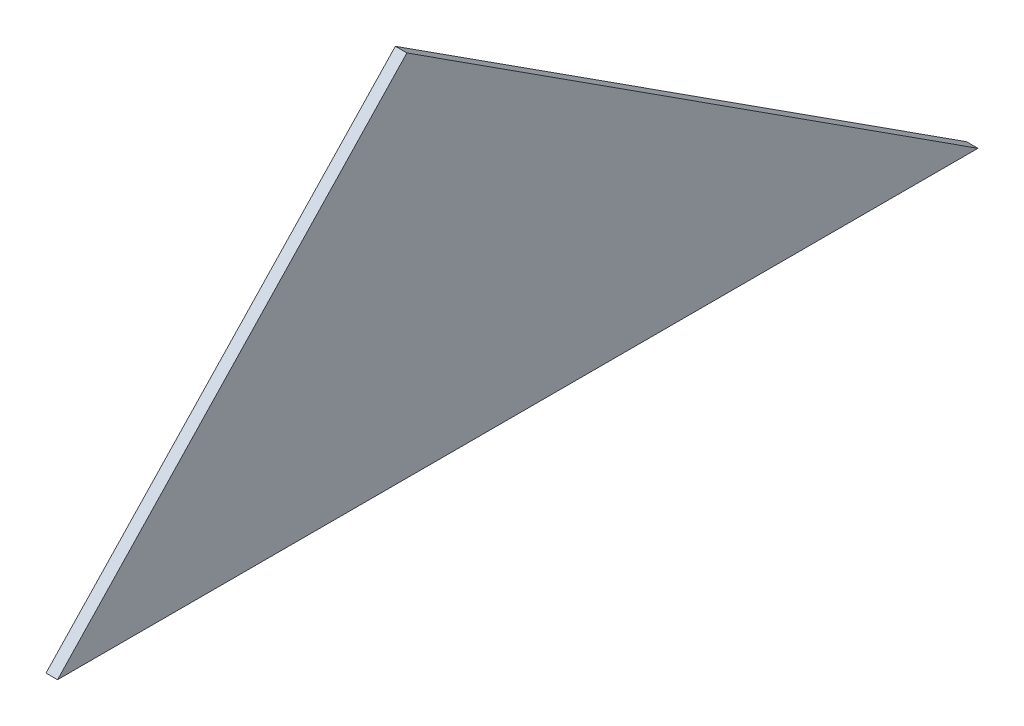
ISO-10303-21;
HEADER;
FILE_DESCRIPTION(('STEP AP214'),'2;1');
FILE_NAME('part.step','',(''),(''),'','','');
FILE_SCHEMA(('AUTOMOTIVE_DESIGN { 1 0 10303 214 1 1 1 1 }'));
ENDSEC;
DATA;
#1=APPLICATION_CONTEXT('core data for automotive mechanical design processes');
#2=APPLICATION_PROTOCOL_DEFINITION('international standard','automotive_design',2000,#1);
#3=PRODUCT_CONTEXT('',#1,'mechanical');
#4=PRODUCT('Part','Part','',(#3));
#5=PRODUCT_RELATED_PRODUCT_CATEGORY('part','',(#4));
#6=PRODUCT_DEFINITION_FORMATION('','',#4);
#7=PRODUCT_DEFINITION_CONTEXT('part definition',#1,'design');
#8=PRODUCT_DEFINITION('design','',#6,#7);
#9=PRODUCT_DEFINITION_SHAPE('','',#8);
#10=(LENGTH_UNIT() NAMED_UNIT(*) SI_UNIT(.MILLI.,.METRE.));
#11=(NAMED_UNIT(*) PLANE_ANGLE_UNIT() SI_UNIT($,.RADIAN.));
#12=(NAMED_UNIT(*) SI_UNIT($,.STERADIAN.) SOLID_ANGLE_UNIT());
#13=UNCERTAINTY_MEASURE_WITH_UNIT(LENGTH_MEASURE(1.E-05),#10,'distance_accuracy_value','');
#14=(GEOMETRIC_REPRESENTATION_CONTEXT(3) GLOBAL_UNCERTAINTY_ASSIGNED_CONTEXT((#13)) GLOBAL_UNIT_ASSIGNED_CONTEXT((#10,
#11,#12)) REPRESENTATION_CONTEXT('',''));
#15=CARTESIAN_POINT('',(0.,0.,0.));
#16=DIRECTION('',(0.,0.,1.));
#17=DIRECTION('',(1.,0.,0.));
#18=AXIS2_PLACEMENT_3D('',#15,#16,#17);
#19=CARTESIAN_POINT('',(6.35,202.669599260832,-192.326268448836));
#20=DIRECTION('',(0.,-0.688354575693758,-0.725374371012284));
#21=DIRECTION('',(0.,0.725374371012284,-0.688354575693758));
#22=AXIS2_PLACEMENT_3D('',#19,#20,#21);
#23=PLANE('',#22);
#24=DIRECTION('',(0.,-0.725374371012284,0.688354575693758));
#25=VECTOR('',#24,1.);
#26=CARTESIAN_POINT('',(0.,202.669599260832,-192.326268448836));
#27=LINE('',#26,#25);
#28=CARTESIAN_POINT('',(0.,202.669599260832,-192.326268448836));
#29=VERTEX_POINT('',#28);
#30=CARTESIAN_POINT('',(0.,0.,0.));
#31=VERTEX_POINT('',#30);
#32=EDGE_CURVE('E80',#29,#31,#27,.T.);
#33=ORIENTED_EDGE('',*,*,#32,.T.);
#34=DIRECTION('',(-1.,0.,0.));
#35=VECTOR('',#34,1.);
#36=CARTESIAN_POINT('',(6.35,0.,0.));
#37=LINE('',#36,#35);
#38=CARTESIAN_POINT('',(6.35,0.,0.));
#39=VERTEX_POINT('',#38);
#40=EDGE_CURVE('E11',#39,#31,#37,.T.);
#41=ORIENTED_EDGE('',*,*,#40,.F.);
#42=DIRECTION('',(0.,-0.725374371012284,0.688354575693758));
#43=VECTOR('',#42,1.);
#44=CARTESIAN_POINT('',(6.35,202.669599260832,-192.326268448836));
#45=LINE('',#44,#43);
#46=CARTESIAN_POINT('',(6.35,202.669599260832,-192.326268448836));
#47=VERTEX_POINT('',#46);
#48=EDGE_CURVE('E73',#47,#39,#45,.T.);
#49=ORIENTED_EDGE('',*,*,#48,.F.);
#50=DIRECTION('',(-1.,0.,0.));
#51=VECTOR('',#50,1.);
#52=CARTESIAN_POINT('',(6.35,202.669599260832,-192.326268448836));
#53=LINE('',#52,#51);
#54=EDGE_CURVE('E81',#47,#29,#53,.T.);
#55=ORIENTED_EDGE('',*,*,#54,.T.);
#56=EDGE_LOOP('',(#33,#41,#49,#55));
#57=FACE_BOUND('',#56,.T.);
#58=ADVANCED_FACE('F33',(#57),#23,.F.);
#59=CARTESIAN_POINT('',(6.35,0.,0.));
#60=DIRECTION('',(0.,1.,0.));
#61=DIRECTION('',(0.,0.,1.));
#62=AXIS2_PLACEMENT_3D('',#59,#60,#61);
#63=PLANE('',#62);
#64=DIRECTION('',(0.,0.,-1.));
#65=VECTOR('',#64,1.);
#66=CARTESIAN_POINT('',(0.,0.,0.));
#67=LINE('',#66,#65);
#68=CARTESIAN_POINT('',(0.,0.,-506.73));
#69=VERTEX_POINT('',#68);
#70=EDGE_CURVE('E61',#31,#69,#67,.T.);
#71=ORIENTED_EDGE('',*,*,#70,.T.);
#72=DIRECTION('',(-1.,0.,0.));
#73=VECTOR('',#72,1.);
#74=CARTESIAN_POINT('',(6.35,0.,-506.73));
#75=LINE('',#74,#73);
#76=CARTESIAN_POINT('',(6.35,0.,-506.73));
#77=VERTEX_POINT('',#76);
#78=EDGE_CURVE('E41',#77,#69,#75,.T.);
#79=ORIENTED_EDGE('',*,*,#78,.F.);
#80=DIRECTION('',(0.,0.,-1.));
#81=VECTOR('',#80,1.);
#82=CARTESIAN_POINT('',(6.35,0.,0.));
#83=LINE('',#82,#81);
#84=EDGE_CURVE('E69',#39,#77,#83,.T.);
#85=ORIENTED_EDGE('',*,*,#84,.F.);
#86=ORIENTED_EDGE('',*,*,#40,.T.);
#87=EDGE_LOOP('',(#71,#79,#85,#86));
#88=FACE_BOUND('',#87,.T.);
#89=ADVANCED_FACE('F70',(#88),#63,.F.);
#90=CARTESIAN_POINT('',(6.35,0.,-506.73));
#91=DIRECTION('',(0.,-0.840505465335995,0.541803066381432));
#92=DIRECTION('',(0.,-0.541803066381432,-0.840505465335995));
#93=AXIS2_PLACEMENT_3D('',#90,#91,#92);
#94=PLANE('',#93);
#95=DIRECTION('',(0.,0.541803066381432,0.840505465335995));
#96=VECTOR('',#95,1.);
#97=CARTESIAN_POINT('',(0.,0.,-506.73));
#98=LINE('',#97,#96);
#99=EDGE_CURVE('E66',#69,#29,#98,.T.);
#100=ORIENTED_EDGE('',*,*,#99,.T.);
#101=ORIENTED_EDGE('',*,*,#54,.F.);
#102=DIRECTION('',(0.,0.541803066381432,0.840505465335995));
#103=VECTOR('',#102,1.);
#104=CARTESIAN_POINT('',(6.35,0.,-506.73));
#105=LINE('',#104,#103);
#106=EDGE_CURVE('E49',#77,#47,#105,.T.);
#107=ORIENTED_EDGE('',*,*,#106,.F.);
#108=ORIENTED_EDGE('',*,*,#78,.T.);
#109=EDGE_LOOP('',(#100,#101,#107,#108));
#110=FACE_BOUND('',#109,.T.);
#111=ADVANCED_FACE('F88',(#110),#94,.F.);
#112=CARTESIAN_POINT('',(6.35,0.,0.));
#113=DIRECTION('',(-1.,0.,0.));
#114=DIRECTION('',(0.,0.,1.));
#115=AXIS2_PLACEMENT_3D('',#112,#113,#114);
#116=PLANE('',#115);
#117=ORIENTED_EDGE('',*,*,#48,.T.);
#118=ORIENTED_EDGE('',*,*,#84,.T.);
#119=ORIENTED_EDGE('',*,*,#106,.T.);
#120=EDGE_LOOP('',(#117,#118,#119));
#121=FACE_BOUND('',#120,.T.);
#122=ADVANCED_FACE('F76',(#121),#116,.F.);
#123=CARTESIAN_POINT('',(0.,0.,0.));
#124=DIRECTION('',(-1.,0.,0.));
#125=DIRECTION('',(0.,0.,1.));
#126=AXIS2_PLACEMENT_3D('',#123,#124,#125);
#127=PLANE('',#126);
#128=ORIENTED_EDGE('',*,*,#32,.F.);
#129=ORIENTED_EDGE('',*,*,#99,.F.);
#130=ORIENTED_EDGE('',*,*,#70,.F.);
#131=EDGE_LOOP('',(#128,#129,#130));
#132=FACE_BOUND('',#131,.T.);
#133=ADVANCED_FACE('F89',(#132),#127,.T.);
#134=CLOSED_SHELL('',(#58,#89,#111,#122,#133));
#135=MANIFOLD_SOLID_BREP('B2',#134);
#136=ADVANCED_BREP_SHAPE_REPRESENTATION('',(#18,#135),#14);
#137=SHAPE_DEFINITION_REPRESENTATION(#9,#136);
ENDSEC;
END-ISO-10303-21;
